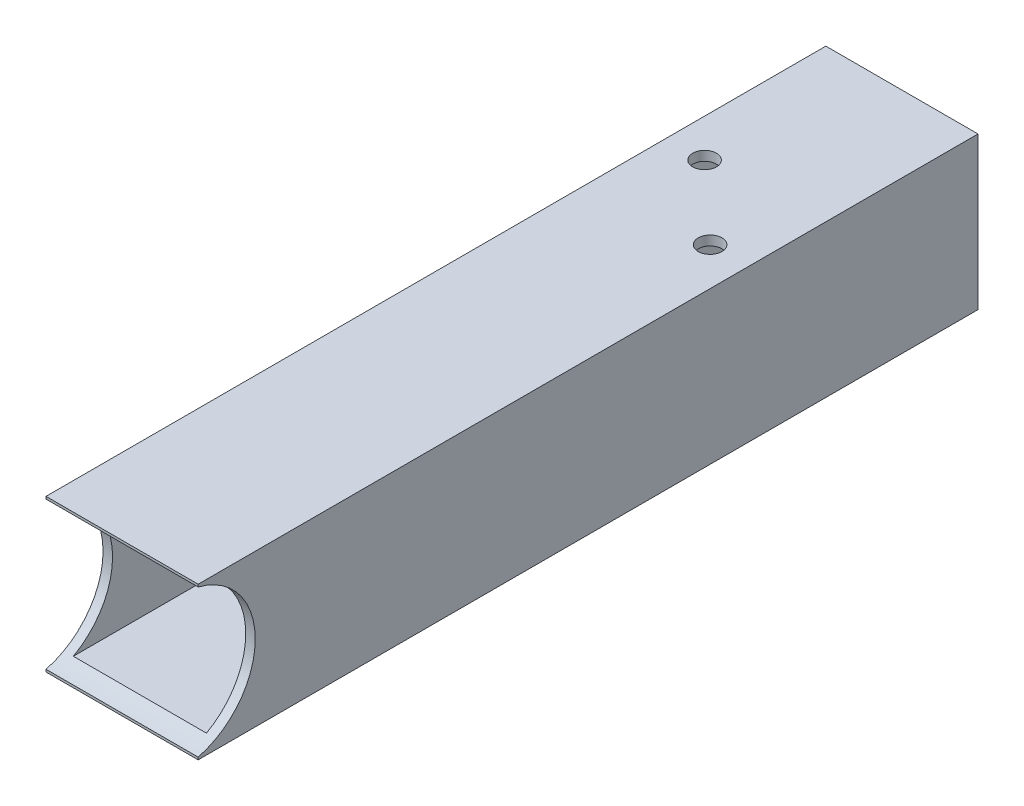
ISO-10303-21;
HEADER;
FILE_DESCRIPTION(('STEP AP214'),'2;1');
FILE_NAME('part.step','',(''),(''),'','','');
FILE_SCHEMA(('AUTOMOTIVE_DESIGN { 1 0 10303 214 1 1 1 1 }'));
ENDSEC;
DATA;
#1=APPLICATION_CONTEXT('core data for automotive mechanical design processes');
#2=APPLICATION_PROTOCOL_DEFINITION('international standard','automotive_design',2000,#1);
#3=PRODUCT_CONTEXT('',#1,'mechanical');
#4=PRODUCT('Part','Part','',(#3));
#5=PRODUCT_RELATED_PRODUCT_CATEGORY('part','',(#4));
#6=PRODUCT_DEFINITION_FORMATION('','',#4);
#7=PRODUCT_DEFINITION_CONTEXT('part definition',#1,'design');
#8=PRODUCT_DEFINITION('design','',#6,#7);
#9=PRODUCT_DEFINITION_SHAPE('','',#8);
#10=(LENGTH_UNIT() NAMED_UNIT(*) SI_UNIT(.MILLI.,.METRE.));
#11=(NAMED_UNIT(*) PLANE_ANGLE_UNIT() SI_UNIT($,.RADIAN.));
#12=(NAMED_UNIT(*) SI_UNIT($,.STERADIAN.) SOLID_ANGLE_UNIT());
#13=UNCERTAINTY_MEASURE_WITH_UNIT(LENGTH_MEASURE(1.E-05),#10,'distance_accuracy_value','');
#14=(GEOMETRIC_REPRESENTATION_CONTEXT(3) GLOBAL_UNCERTAINTY_ASSIGNED_CONTEXT((#13)) GLOBAL_UNIT_ASSIGNED_CONTEXT((#10,
#11,#12)) REPRESENTATION_CONTEXT('',''));
#15=CARTESIAN_POINT('',(0.,0.,0.));
#16=DIRECTION('',(0.,0.,1.));
#17=DIRECTION('',(1.,0.,0.));
#18=AXIS2_PLACEMENT_3D('',#15,#16,#17);
#19=CARTESIAN_POINT('',(0.,0.,260.35));
#20=DIRECTION('',(0.,0.,-1.));
#21=DIRECTION('',(-1.,0.,0.));
#22=AXIS2_PLACEMENT_3D('',#19,#20,#21);
#23=PLANE('',#22);
#24=DIRECTION('',(0.,-1.,0.));
#25=VECTOR('',#24,1.);
#26=CARTESIAN_POINT('',(0.,0.,260.35));
#27=LINE('',#26,#25);
#28=CARTESIAN_POINT('',(0.,50.8,260.35));
#29=VERTEX_POINT('',#28);
#30=CARTESIAN_POINT('',(0.,49.9934442484171,260.35));
#31=VERTEX_POINT('',#30);
#32=EDGE_CURVE('E130',#29,#31,#27,.T.);
#33=ORIENTED_EDGE('',*,*,#32,.T.);
#34=DIRECTION('',(1.,0.,0.));
#35=VECTOR('',#34,1.);
#36=CARTESIAN_POINT('',(0.,49.9934442484171,260.35));
#37=LINE('',#36,#35);
#38=CARTESIAN_POINT('',(50.8,49.9934442484171,260.35));
#39=VERTEX_POINT('',#38);
#40=EDGE_CURVE('E116',#31,#39,#37,.T.);
#41=ORIENTED_EDGE('',*,*,#40,.T.);
#42=DIRECTION('',(0.,1.,0.));
#43=VECTOR('',#42,1.);
#44=CARTESIAN_POINT('',(50.8,0.,260.35));
#45=LINE('',#44,#43);
#46=CARTESIAN_POINT('',(50.8,50.8,260.35));
#47=VERTEX_POINT('',#46);
#48=EDGE_CURVE('E140',#39,#47,#45,.T.);
#49=ORIENTED_EDGE('',*,*,#48,.T.);
#50=DIRECTION('',(-1.,0.,0.));
#51=VECTOR('',#50,1.);
#52=CARTESIAN_POINT('',(0.,50.8,260.35));
#53=LINE('',#52,#51);
#54=EDGE_CURVE('E136',#47,#29,#53,.T.);
#55=ORIENTED_EDGE('',*,*,#54,.T.);
#56=EDGE_LOOP('',(#33,#41,#49,#55));
#57=FACE_BOUND('',#56,.T.);
#58=ADVANCED_FACE('F40',(#57),#23,.F.);
#59=CARTESIAN_POINT('',(50.8,0.,260.35));
#60=VERTEX_POINT('',#59);
#61=CARTESIAN_POINT('',(50.8,0.806555751582911,260.35));
#62=VERTEX_POINT('',#61);
#63=EDGE_CURVE('E147',#60,#62,#45,.T.);
#64=ORIENTED_EDGE('',*,*,#63,.T.);
#65=DIRECTION('',(1.,0.,0.));
#66=VECTOR('',#65,1.);
#67=CARTESIAN_POINT('',(0.,0.806555751582911,260.35));
#68=LINE('',#67,#66);
#69=CARTESIAN_POINT('',(0.,0.806555751582911,260.35));
#70=VERTEX_POINT('',#69);
#71=EDGE_CURVE('E57',#62,#70,#68,.F.);
#72=ORIENTED_EDGE('',*,*,#71,.T.);
#73=CARTESIAN_POINT('',(0.,0.,260.35));
#74=VERTEX_POINT('',#73);
#75=EDGE_CURVE('E132',#70,#74,#27,.T.);
#76=ORIENTED_EDGE('',*,*,#75,.T.);
#77=DIRECTION('',(1.,0.,0.));
#78=VECTOR('',#77,1.);
#79=CARTESIAN_POINT('',(0.,0.,260.35));
#80=LINE('',#79,#78);
#81=EDGE_CURVE('E138',#74,#60,#80,.T.);
#82=ORIENTED_EDGE('',*,*,#81,.T.);
#83=EDGE_LOOP('',(#64,#72,#76,#82));
#84=FACE_BOUND('',#83,.T.);
#85=ADVANCED_FACE('F245',(#84),#23,.F.);
#86=CARTESIAN_POINT('',(0.,0.,0.));
#87=DIRECTION('',(0.,0.,-1.));
#88=DIRECTION('',(-1.,0.,0.));
#89=AXIS2_PLACEMENT_3D('',#86,#87,#88);
#90=PLANE('',#89);
#91=DIRECTION('',(0.,-1.,0.));
#92=VECTOR('',#91,1.);
#93=CARTESIAN_POINT('',(0.,0.,0.));
#94=LINE('',#93,#92);
#95=CARTESIAN_POINT('',(0.,50.8,0.));
#96=VERTEX_POINT('',#95);
#97=CARTESIAN_POINT('',(0.,0.,0.));
#98=VERTEX_POINT('',#97);
#99=EDGE_CURVE('E152',#96,#98,#94,.T.);
#100=ORIENTED_EDGE('',*,*,#99,.F.);
#101=DIRECTION('',(-1.,0.,0.));
#102=VECTOR('',#101,1.);
#103=CARTESIAN_POINT('',(0.,50.8,0.));
#104=LINE('',#103,#102);
#105=CARTESIAN_POINT('',(50.8,50.8,0.));
#106=VERTEX_POINT('',#105);
#107=EDGE_CURVE('E142',#106,#96,#104,.T.);
#108=ORIENTED_EDGE('',*,*,#107,.F.);
#109=DIRECTION('',(0.,1.,0.));
#110=VECTOR('',#109,1.);
#111=CARTESIAN_POINT('',(50.8,0.,0.));
#112=LINE('',#111,#110);
#113=CARTESIAN_POINT('',(50.8,0.,0.));
#114=VERTEX_POINT('',#113);
#115=EDGE_CURVE('E157',#114,#106,#112,.T.);
#116=ORIENTED_EDGE('',*,*,#115,.F.);
#117=DIRECTION('',(1.,0.,0.));
#118=VECTOR('',#117,1.);
#119=CARTESIAN_POINT('',(0.,0.,0.));
#120=LINE('',#119,#118);
#121=EDGE_CURVE('E155',#98,#114,#120,.T.);
#122=ORIENTED_EDGE('',*,*,#121,.F.);
#123=EDGE_LOOP('',(#100,#108,#116,#122));
#124=FACE_BOUND('',#123,.T.);
#125=DIRECTION('',(-1.,0.,0.));
#126=VECTOR('',#125,1.);
#127=CARTESIAN_POINT('',(3.175,47.625,0.));
#128=LINE('',#127,#126);
#129=CARTESIAN_POINT('',(47.625,47.625,0.));
#130=VERTEX_POINT('',#129);
#131=CARTESIAN_POINT('',(3.175,47.625,0.));
#132=VERTEX_POINT('',#131);
#133=EDGE_CURVE('E207',#130,#132,#128,.T.);
#134=ORIENTED_EDGE('',*,*,#133,.T.);
#135=DIRECTION('',(0.,-1.,0.));
#136=VECTOR('',#135,1.);
#137=CARTESIAN_POINT('',(3.175,3.175,0.));
#138=LINE('',#137,#136);
#139=CARTESIAN_POINT('',(3.175,3.175,0.));
#140=VERTEX_POINT('',#139);
#141=EDGE_CURVE('E124',#132,#140,#138,.T.);
#142=ORIENTED_EDGE('',*,*,#141,.T.);
#143=DIRECTION('',(1.,0.,0.));
#144=VECTOR('',#143,1.);
#145=CARTESIAN_POINT('',(3.175,3.175,0.));
#146=LINE('',#145,#144);
#147=CARTESIAN_POINT('',(47.625,3.175,0.));
#148=VERTEX_POINT('',#147);
#149=EDGE_CURVE('E201',#140,#148,#146,.T.);
#150=ORIENTED_EDGE('',*,*,#149,.T.);
#151=DIRECTION('',(0.,1.,0.));
#152=VECTOR('',#151,1.);
#153=CARTESIAN_POINT('',(47.625,3.175,0.));
#154=LINE('',#153,#152);
#155=EDGE_CURVE('E204',#148,#130,#154,.T.);
#156=ORIENTED_EDGE('',*,*,#155,.T.);
#157=EDGE_LOOP('',(#134,#142,#150,#156));
#158=FACE_BOUND('',#157,.T.);
#159=ADVANCED_FACE('F226',(#124,#158),#90,.T.);
#160=CARTESIAN_POINT('',(0.,0.,260.35));
#161=DIRECTION('',(1.,0.,0.));
#162=DIRECTION('',(0.,0.,-1.));
#163=AXIS2_PLACEMENT_3D('',#160,#161,#162);
#164=PLANE('',#163);
#165=ORIENTED_EDGE('',*,*,#75,.F.);
#166=CARTESIAN_POINT('',(0.,25.4,266.7));
#167=DIRECTION('',(1.,0.,0.));
#168=DIRECTION('',(0.,0.,-1.));
#169=AXIS2_PLACEMENT_3D('',#166,#167,#168);
#170=CIRCLE('',#169,25.4);
#171=EDGE_CURVE('E119',#70,#31,#170,.T.);
#172=ORIENTED_EDGE('',*,*,#171,.T.);
#173=ORIENTED_EDGE('',*,*,#32,.F.);
#174=DIRECTION('',(0.,0.,-1.));
#175=VECTOR('',#174,1.);
#176=CARTESIAN_POINT('',(0.,50.8,260.35));
#177=LINE('',#176,#175);
#178=EDGE_CURVE('E151',#29,#96,#177,.T.);
#179=ORIENTED_EDGE('',*,*,#178,.T.);
#180=ORIENTED_EDGE('',*,*,#99,.T.);
#181=DIRECTION('',(0.,0.,-1.));
#182=VECTOR('',#181,1.);
#183=CARTESIAN_POINT('',(0.,0.,260.35));
#184=LINE('',#183,#182);
#185=EDGE_CURVE('E49',#74,#98,#184,.T.);
#186=ORIENTED_EDGE('',*,*,#185,.F.);
#187=EDGE_LOOP('',(#165,#172,#173,#179,#180,#186));
#188=FACE_BOUND('',#187,.T.);
#189=ADVANCED_FACE('F42',(#188),#164,.F.);
#190=CARTESIAN_POINT('',(0.,0.,260.35));
#191=DIRECTION('',(0.,1.,0.));
#192=DIRECTION('',(0.,0.,1.));
#193=AXIS2_PLACEMENT_3D('',#190,#191,#192);
#194=PLANE('',#193);
#195=CARTESIAN_POINT('',(12.7000000000002,0.,53.1750000000008));
#196=DIRECTION('',(0.,-1.,0.));
#197=DIRECTION('',(0.,0.,-1.));
#198=AXIS2_PLACEMENT_3D('',#195,#196,#197);
#199=CIRCLE('',#198,3.96875);
#200=CARTESIAN_POINT('',(12.7000000000002,0.,49.2062500000008));
#201=VERTEX_POINT('',#200);
#202=EDGE_CURVE('E177',#201,#201,#199,.T.);
#203=ORIENTED_EDGE('',*,*,#202,.F.);
#204=EDGE_LOOP('',(#203));
#205=FACE_BOUND('',#204,.T.);
#206=CARTESIAN_POINT('',(38.0999999999999,0.,76.7358336848298));
#207=DIRECTION('',(0.,-1.,0.));
#208=DIRECTION('',(0.,0.,-1.));
#209=AXIS2_PLACEMENT_3D('',#206,#207,#208);
#210=CIRCLE('',#209,3.96875);
#211=CARTESIAN_POINT('',(38.0999999999999,0.,72.7670836848298));
#212=VERTEX_POINT('',#211);
#213=EDGE_CURVE('E187',#212,#212,#210,.T.);
#214=ORIENTED_EDGE('',*,*,#213,.F.);
#215=EDGE_LOOP('',(#214));
#216=FACE_BOUND('',#215,.T.);
#217=ORIENTED_EDGE('',*,*,#121,.T.);
#218=DIRECTION('',(0.,0.,-1.));
#219=VECTOR('',#218,1.);
#220=CARTESIAN_POINT('',(50.8,0.,260.35));
#221=LINE('',#220,#219);
#222=EDGE_CURVE('E164',#60,#114,#221,.T.);
#223=ORIENTED_EDGE('',*,*,#222,.F.);
#224=ORIENTED_EDGE('',*,*,#81,.F.);
#225=ORIENTED_EDGE('',*,*,#185,.T.);
#226=EDGE_LOOP('',(#217,#223,#224,#225));
#227=FACE_BOUND('',#226,.T.);
#228=ADVANCED_FACE('F261',(#205,#216,#227),#194,.F.);
#229=CARTESIAN_POINT('',(50.8,0.,260.35));
#230=DIRECTION('',(-1.,0.,0.));
#231=DIRECTION('',(0.,0.,1.));
#232=AXIS2_PLACEMENT_3D('',#229,#230,#231);
#233=PLANE('',#232);
#234=ORIENTED_EDGE('',*,*,#48,.F.);
#235=CARTESIAN_POINT('',(50.8,25.4,266.7));
#236=DIRECTION('',(1.,0.,0.));
#237=DIRECTION('',(0.,0.,-1.));
#238=AXIS2_PLACEMENT_3D('',#235,#236,#237);
#239=CIRCLE('',#238,25.4);
#240=EDGE_CURVE('E120',#62,#39,#239,.T.);
#241=ORIENTED_EDGE('',*,*,#240,.F.);
#242=ORIENTED_EDGE('',*,*,#63,.F.);
#243=ORIENTED_EDGE('',*,*,#222,.T.);
#244=ORIENTED_EDGE('',*,*,#115,.T.);
#245=DIRECTION('',(0.,0.,-1.));
#246=VECTOR('',#245,1.);
#247=CARTESIAN_POINT('',(50.8,50.8,260.35));
#248=LINE('',#247,#246);
#249=EDGE_CURVE('E161',#47,#106,#248,.T.);
#250=ORIENTED_EDGE('',*,*,#249,.F.);
#251=EDGE_LOOP('',(#234,#241,#242,#243,#244,#250));
#252=FACE_BOUND('',#251,.T.);
#253=ADVANCED_FACE('F259',(#252),#233,.F.);
#254=CARTESIAN_POINT('',(0.,50.8,260.35));
#255=DIRECTION('',(0.,-1.,0.));
#256=DIRECTION('',(0.,0.,-1.));
#257=AXIS2_PLACEMENT_3D('',#254,#255,#256);
#258=PLANE('',#257);
#259=CARTESIAN_POINT('',(12.7000000000002,50.8,53.1750000000008));
#260=DIRECTION('',(0.,-1.,0.));
#261=DIRECTION('',(0.,0.,-1.));
#262=AXIS2_PLACEMENT_3D('',#259,#260,#261);
#263=CIRCLE('',#262,3.96875);
#264=CARTESIAN_POINT('',(12.7000000000002,50.8,49.2062500000008));
#265=VERTEX_POINT('',#264);
#266=EDGE_CURVE('E171',#265,#265,#263,.T.);
#267=ORIENTED_EDGE('',*,*,#266,.T.);
#268=EDGE_LOOP('',(#267));
#269=FACE_BOUND('',#268,.T.);
#270=CARTESIAN_POINT('',(38.0999999999999,50.8,76.7358336848298));
#271=DIRECTION('',(0.,-1.,0.));
#272=DIRECTION('',(0.,0.,-1.));
#273=AXIS2_PLACEMENT_3D('',#270,#271,#272);
#274=CIRCLE('',#273,3.96875);
#275=CARTESIAN_POINT('',(38.0999999999999,50.8,72.7670836848298));
#276=VERTEX_POINT('',#275);
#277=EDGE_CURVE('E182',#276,#276,#274,.T.);
#278=ORIENTED_EDGE('',*,*,#277,.T.);
#279=EDGE_LOOP('',(#278));
#280=FACE_BOUND('',#279,.T.);
#281=ORIENTED_EDGE('',*,*,#107,.T.);
#282=ORIENTED_EDGE('',*,*,#178,.F.);
#283=ORIENTED_EDGE('',*,*,#54,.F.);
#284=ORIENTED_EDGE('',*,*,#249,.T.);
#285=EDGE_LOOP('',(#281,#282,#283,#284));
#286=FACE_BOUND('',#285,.T.);
#287=ADVANCED_FACE('F256',(#269,#280,#286),#258,.F.);
#288=CARTESIAN_POINT('',(3.175,3.175,260.35));
#289=DIRECTION('',(1.,0.,0.));
#290=DIRECTION('',(0.,0.,-1.));
#291=AXIS2_PLACEMENT_3D('',#288,#289,#290);
#292=PLANE('',#291);
#293=CARTESIAN_POINT('',(3.175,25.4,266.7));
#294=DIRECTION('',(1.,0.,0.));
#295=DIRECTION('',(0.,0.,-1.));
#296=AXIS2_PLACEMENT_3D('',#293,#294,#295);
#297=CIRCLE('',#296,25.4);
#298=CARTESIAN_POINT('',(3.175,3.175,254.403277875791));
#299=VERTEX_POINT('',#298);
#300=CARTESIAN_POINT('',(3.175,47.625,254.403277875791));
#301=VERTEX_POINT('',#300);
#302=EDGE_CURVE('E64',#299,#301,#297,.T.);
#303=ORIENTED_EDGE('',*,*,#302,.F.);
#304=DIRECTION('',(0.,0.,-1.));
#305=VECTOR('',#304,1.);
#306=CARTESIAN_POINT('',(3.175,3.175,260.35));
#307=LINE('',#306,#305);
#308=EDGE_CURVE('E144',#299,#140,#307,.T.);
#309=ORIENTED_EDGE('',*,*,#308,.T.);
#310=ORIENTED_EDGE('',*,*,#141,.F.);
#311=DIRECTION('',(0.,0.,-1.));
#312=VECTOR('',#311,1.);
#313=CARTESIAN_POINT('',(3.175,47.625,260.35));
#314=LINE('',#313,#312);
#315=EDGE_CURVE('E210',#301,#132,#314,.T.);
#316=ORIENTED_EDGE('',*,*,#315,.F.);
#317=EDGE_LOOP('',(#303,#309,#310,#316));
#318=FACE_BOUND('',#317,.T.);
#319=ADVANCED_FACE('F222',(#318),#292,.T.);
#320=CARTESIAN_POINT('',(3.175,3.175,260.35));
#321=DIRECTION('',(0.,1.,0.));
#322=DIRECTION('',(0.,0.,1.));
#323=AXIS2_PLACEMENT_3D('',#320,#321,#322);
#324=PLANE('',#323);
#325=CARTESIAN_POINT('',(12.7000000000002,3.175,53.1750000000008));
#326=DIRECTION('',(0.,1.,0.));
#327=DIRECTION('',(0.,0.,1.));
#328=AXIS2_PLACEMENT_3D('',#325,#326,#327);
#329=CIRCLE('',#328,3.96875);
#330=CARTESIAN_POINT('',(12.7000000000002,3.175,57.1437500000008));
#331=VERTEX_POINT('',#330);
#332=EDGE_CURVE('E190',#331,#331,#329,.T.);
#333=ORIENTED_EDGE('',*,*,#332,.F.);
#334=EDGE_LOOP('',(#333));
#335=FACE_BOUND('',#334,.T.);
#336=CARTESIAN_POINT('',(38.0999999999999,3.175,76.7358336848298));
#337=DIRECTION('',(0.,1.,0.));
#338=DIRECTION('',(0.,0.,1.));
#339=AXIS2_PLACEMENT_3D('',#336,#337,#338);
#340=CIRCLE('',#339,3.96875);
#341=CARTESIAN_POINT('',(38.0999999999999,3.175,80.7045836848298));
#342=VERTEX_POINT('',#341);
#343=EDGE_CURVE('E170',#342,#342,#340,.T.);
#344=ORIENTED_EDGE('',*,*,#343,.F.);
#345=EDGE_LOOP('',(#344));
#346=FACE_BOUND('',#345,.T.);
#347=DIRECTION('',(1.,0.,0.));
#348=VECTOR('',#347,1.);
#349=CARTESIAN_POINT('',(0.,3.175,254.403277875791));
#350=LINE('',#349,#348);
#351=CARTESIAN_POINT('',(47.625,3.175,254.403277875791));
#352=VERTEX_POINT('',#351);
#353=EDGE_CURVE('E195',#352,#299,#350,.F.);
#354=ORIENTED_EDGE('',*,*,#353,.F.);
#355=DIRECTION('',(0.,0.,-1.));
#356=VECTOR('',#355,1.);
#357=CARTESIAN_POINT('',(47.625,3.175,260.35));
#358=LINE('',#357,#356);
#359=EDGE_CURVE('E213',#352,#148,#358,.T.);
#360=ORIENTED_EDGE('',*,*,#359,.T.);
#361=ORIENTED_EDGE('',*,*,#149,.F.);
#362=ORIENTED_EDGE('',*,*,#308,.F.);
#363=EDGE_LOOP('',(#354,#360,#361,#362));
#364=FACE_BOUND('',#363,.T.);
#365=ADVANCED_FACE('F224',(#335,#346,#364),#324,.T.);
#366=CARTESIAN_POINT('',(47.625,3.175,260.35));
#367=DIRECTION('',(-1.,0.,0.));
#368=DIRECTION('',(0.,0.,1.));
#369=AXIS2_PLACEMENT_3D('',#366,#367,#368);
#370=PLANE('',#369);
#371=CARTESIAN_POINT('',(47.625,25.4,266.7));
#372=DIRECTION('',(-1.,0.,0.));
#373=DIRECTION('',(0.,0.,1.));
#374=AXIS2_PLACEMENT_3D('',#371,#372,#373);
#375=CIRCLE('',#374,25.4);
#376=CARTESIAN_POINT('',(47.625,47.625,254.403277875791));
#377=VERTEX_POINT('',#376);
#378=EDGE_CURVE('E133',#377,#352,#375,.T.);
#379=ORIENTED_EDGE('',*,*,#378,.F.);
#380=DIRECTION('',(0.,0.,-1.));
#381=VECTOR('',#380,1.);
#382=CARTESIAN_POINT('',(47.625,47.625,260.35));
#383=LINE('',#382,#381);
#384=EDGE_CURVE('E212',#377,#130,#383,.T.);
#385=ORIENTED_EDGE('',*,*,#384,.T.);
#386=ORIENTED_EDGE('',*,*,#155,.F.);
#387=ORIENTED_EDGE('',*,*,#359,.F.);
#388=EDGE_LOOP('',(#379,#385,#386,#387));
#389=FACE_BOUND('',#388,.T.);
#390=ADVANCED_FACE('F233',(#389),#370,.T.);
#391=CARTESIAN_POINT('',(3.175,47.625,260.35));
#392=DIRECTION('',(0.,-1.,0.));
#393=DIRECTION('',(0.,0.,-1.));
#394=AXIS2_PLACEMENT_3D('',#391,#392,#393);
#395=PLANE('',#394);
#396=CARTESIAN_POINT('',(12.7000000000002,47.625,53.1750000000008));
#397=DIRECTION('',(0.,-1.,0.));
#398=DIRECTION('',(0.,0.,-1.));
#399=AXIS2_PLACEMENT_3D('',#396,#397,#398);
#400=CIRCLE('',#399,3.96875);
#401=CARTESIAN_POINT('',(12.7000000000002,47.625,49.2062500000008));
#402=VERTEX_POINT('',#401);
#403=EDGE_CURVE('E44',#402,#402,#400,.T.);
#404=ORIENTED_EDGE('',*,*,#403,.F.);
#405=EDGE_LOOP('',(#404));
#406=FACE_BOUND('',#405,.T.);
#407=CARTESIAN_POINT('',(38.0999999999999,47.625,76.7358336848298));
#408=DIRECTION('',(0.,-1.,0.));
#409=DIRECTION('',(0.,0.,-1.));
#410=AXIS2_PLACEMENT_3D('',#407,#408,#409);
#411=CIRCLE('',#410,3.96875);
#412=CARTESIAN_POINT('',(38.0999999999999,47.625,72.7670836848298));
#413=VERTEX_POINT('',#412);
#414=EDGE_CURVE('E168',#413,#413,#411,.T.);
#415=ORIENTED_EDGE('',*,*,#414,.F.);
#416=EDGE_LOOP('',(#415));
#417=FACE_BOUND('',#416,.T.);
#418=DIRECTION('',(1.,0.,0.));
#419=VECTOR('',#418,1.);
#420=CARTESIAN_POINT('',(0.,47.625,254.403277875791));
#421=LINE('',#420,#419);
#422=EDGE_CURVE('E11',#301,#377,#421,.T.);
#423=ORIENTED_EDGE('',*,*,#422,.F.);
#424=ORIENTED_EDGE('',*,*,#315,.T.);
#425=ORIENTED_EDGE('',*,*,#133,.F.);
#426=ORIENTED_EDGE('',*,*,#384,.F.);
#427=EDGE_LOOP('',(#423,#424,#425,#426));
#428=FACE_BOUND('',#427,.T.);
#429=ADVANCED_FACE('F230',(#406,#417,#428),#395,.T.);
#430=CARTESIAN_POINT('',(0.,25.4,266.7));
#431=DIRECTION('',(1.,0.,0.));
#432=DIRECTION('',(0.,0.,-1.));
#433=AXIS2_PLACEMENT_3D('',#430,#431,#432);
#434=CYLINDRICAL_SURFACE('',#433,25.4);
#435=ORIENTED_EDGE('',*,*,#302,.T.);
#436=ORIENTED_EDGE('',*,*,#422,.T.);
#437=ORIENTED_EDGE('',*,*,#378,.T.);
#438=ORIENTED_EDGE('',*,*,#353,.T.);
#439=EDGE_LOOP('',(#435,#436,#437,#438));
#440=FACE_BOUND('',#439,.T.);
#441=ORIENTED_EDGE('',*,*,#171,.F.);
#442=ORIENTED_EDGE('',*,*,#71,.F.);
#443=ORIENTED_EDGE('',*,*,#240,.T.);
#444=ORIENTED_EDGE('',*,*,#40,.F.);
#445=EDGE_LOOP('',(#441,#442,#443,#444));
#446=FACE_BOUND('',#445,.T.);
#447=ADVANCED_FACE('F118',(#440,#446),#434,.F.);
#448=CARTESIAN_POINT('',(38.0999999999999,50.8,76.7358336848298));
#449=DIRECTION('',(0.,-1.,0.));
#450=DIRECTION('',(0.,0.,-1.));
#451=AXIS2_PLACEMENT_3D('',#448,#449,#450);
#452=CYLINDRICAL_SURFACE('',#451,3.96875);
#453=ORIENTED_EDGE('',*,*,#414,.T.);
#454=EDGE_LOOP('',(#453));
#455=FACE_BOUND('',#454,.T.);
#456=ORIENTED_EDGE('',*,*,#277,.F.);
#457=EDGE_LOOP('',(#456));
#458=FACE_BOUND('',#457,.T.);
#459=ADVANCED_FACE('F287',(#455,#458),#452,.F.);
#460=CARTESIAN_POINT('',(12.7000000000002,50.8,53.1750000000008));
#461=DIRECTION('',(0.,-1.,0.));
#462=DIRECTION('',(0.,0.,-1.));
#463=AXIS2_PLACEMENT_3D('',#460,#461,#462);
#464=CYLINDRICAL_SURFACE('',#463,3.96875);
#465=ORIENTED_EDGE('',*,*,#403,.T.);
#466=EDGE_LOOP('',(#465));
#467=FACE_BOUND('',#466,.T.);
#468=ORIENTED_EDGE('',*,*,#266,.F.);
#469=EDGE_LOOP('',(#468));
#470=FACE_BOUND('',#469,.T.);
#471=ADVANCED_FACE('F284',(#467,#470),#464,.F.);
#472=ORIENTED_EDGE('',*,*,#343,.T.);
#473=EDGE_LOOP('',(#472));
#474=FACE_BOUND('',#473,.T.);
#475=ORIENTED_EDGE('',*,*,#213,.T.);
#476=EDGE_LOOP('',(#475));
#477=FACE_BOUND('',#476,.T.);
#478=ADVANCED_FACE('F281',(#474,#477),#452,.F.);
#479=ORIENTED_EDGE('',*,*,#332,.T.);
#480=EDGE_LOOP('',(#479));
#481=FACE_BOUND('',#480,.T.);
#482=ORIENTED_EDGE('',*,*,#202,.T.);
#483=EDGE_LOOP('',(#482));
#484=FACE_BOUND('',#483,.T.);
#485=ADVANCED_FACE('F283',(#481,#484),#464,.F.);
#486=CLOSED_SHELL('',(#58,#85,#159,#189,#228,#253,#287,#319,#365,#390,#429,#447,#459,#471,#478,#485));
#487=MANIFOLD_SOLID_BREP('B2',#486);
#488=ADVANCED_BREP_SHAPE_REPRESENTATION('',(#18,#487),#14);
#489=SHAPE_DEFINITION_REPRESENTATION(#9,#488);
ENDSEC;
END-ISO-10303-21;
